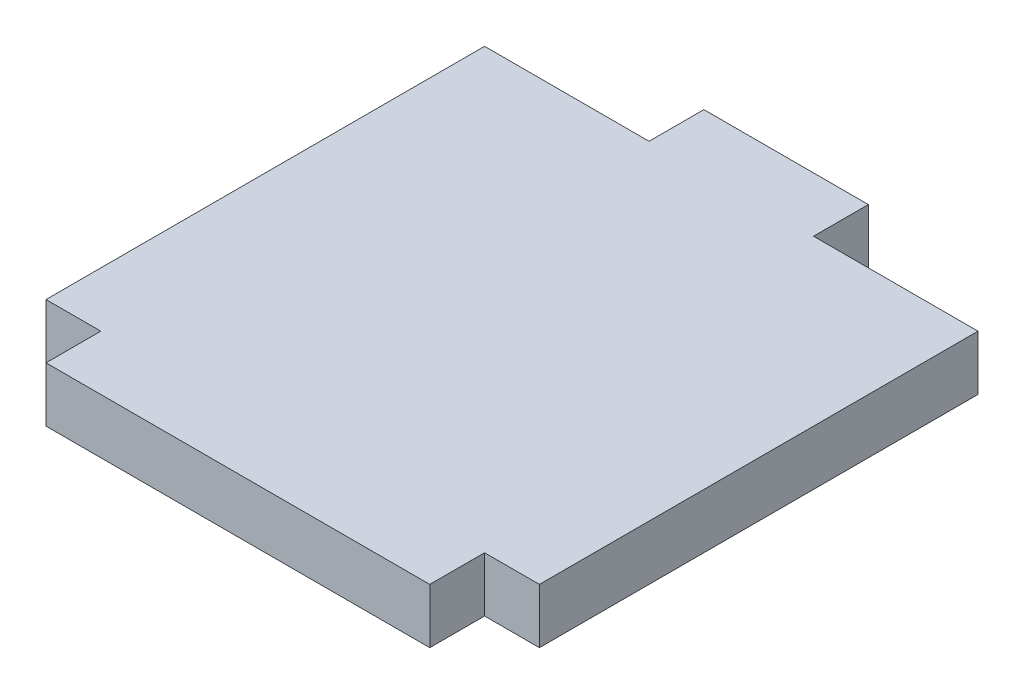
ISO-10303-21;
HEADER;
FILE_DESCRIPTION(('STEP AP214'),'2;1');
FILE_NAME('part.step','',(''),(''),'','','');
FILE_SCHEMA(('AUTOMOTIVE_DESIGN { 1 0 10303 214 1 1 1 1 }'));
ENDSEC;
DATA;
#1=APPLICATION_CONTEXT('core data for automotive mechanical design processes');
#2=APPLICATION_PROTOCOL_DEFINITION('international standard','automotive_design',2000,#1);
#3=PRODUCT_CONTEXT('',#1,'mechanical');
#4=PRODUCT('Part','Part','',(#3));
#5=PRODUCT_RELATED_PRODUCT_CATEGORY('part','',(#4));
#6=PRODUCT_DEFINITION_FORMATION('','',#4);
#7=PRODUCT_DEFINITION_CONTEXT('part definition',#1,'design');
#8=PRODUCT_DEFINITION('design','',#6,#7);
#9=PRODUCT_DEFINITION_SHAPE('','',#8);
#10=(LENGTH_UNIT() NAMED_UNIT(*) SI_UNIT(.MILLI.,.METRE.));
#11=(NAMED_UNIT(*) PLANE_ANGLE_UNIT() SI_UNIT($,.RADIAN.));
#12=(NAMED_UNIT(*) SI_UNIT($,.STERADIAN.) SOLID_ANGLE_UNIT());
#13=UNCERTAINTY_MEASURE_WITH_UNIT(LENGTH_MEASURE(1.E-05),#10,'distance_accuracy_value','');
#14=(GEOMETRIC_REPRESENTATION_CONTEXT(3) GLOBAL_UNCERTAINTY_ASSIGNED_CONTEXT((#13)) GLOBAL_UNIT_ASSIGNED_CONTEXT((#10,
#11,#12)) REPRESENTATION_CONTEXT('',''));
#15=CARTESIAN_POINT('',(0.,0.,0.));
#16=DIRECTION('',(0.,0.,1.));
#17=DIRECTION('',(1.,0.,0.));
#18=AXIS2_PLACEMENT_3D('',#15,#16,#17);
#19=CARTESIAN_POINT('',(0.,5.,-20.));
#20=DIRECTION('',(0.,0.,-1.));
#21=DIRECTION('',(-1.,0.,0.));
#22=AXIS2_PLACEMENT_3D('',#19,#20,#21);
#23=PLANE('',#22);
#24=DIRECTION('',(1.,0.,0.));
#25=VECTOR('',#24,1.);
#26=CARTESIAN_POINT('',(0.,0.,-20.));
#27=LINE('',#26,#25);
#28=CARTESIAN_POINT('',(7.5,0.,-20.));
#29=VERTEX_POINT('',#28);
#30=CARTESIAN_POINT('',(22.5,0.,-20.));
#31=VERTEX_POINT('',#30);
#32=EDGE_CURVE('E175',#29,#31,#27,.T.);
#33=ORIENTED_EDGE('',*,*,#32,.F.);
#34=DIRECTION('',(0.,1.,0.));
#35=VECTOR('',#34,1.);
#36=CARTESIAN_POINT('',(7.5,0.,-20.));
#37=LINE('',#36,#35);
#38=CARTESIAN_POINT('',(7.5,5.,-20.));
#39=VERTEX_POINT('',#38);
#40=EDGE_CURVE('E124',#29,#39,#37,.T.);
#41=ORIENTED_EDGE('',*,*,#40,.T.);
#42=DIRECTION('',(1.,0.,0.));
#43=VECTOR('',#42,1.);
#44=CARTESIAN_POINT('',(0.,5.,-20.));
#45=LINE('',#44,#43);
#46=CARTESIAN_POINT('',(22.5,5.,-20.));
#47=VERTEX_POINT('',#46);
#48=EDGE_CURVE('E118',#39,#47,#45,.T.);
#49=ORIENTED_EDGE('',*,*,#48,.T.);
#50=DIRECTION('',(0.,-1.,0.));
#51=VECTOR('',#50,1.);
#52=CARTESIAN_POINT('',(22.5,5.,-20.));
#53=LINE('',#52,#51);
#54=EDGE_CURVE('E122',#47,#31,#53,.T.);
#55=ORIENTED_EDGE('',*,*,#54,.T.);
#56=EDGE_LOOP('',(#33,#41,#49,#55));
#57=FACE_BOUND('',#56,.T.);
#58=ADVANCED_FACE('F36',(#57),#23,.T.);
#59=CARTESIAN_POINT('',(0.,5.,20.));
#60=DIRECTION('',(0.,0.,-1.));
#61=DIRECTION('',(-1.,0.,0.));
#62=AXIS2_PLACEMENT_3D('',#59,#60,#61);
#63=PLANE('',#62);
#64=DIRECTION('',(1.,0.,0.));
#65=VECTOR('',#64,1.);
#66=CARTESIAN_POINT('',(0.,0.,20.));
#67=LINE('',#66,#65);
#68=CARTESIAN_POINT('',(-22.5,0.,20.));
#69=VERTEX_POINT('',#68);
#70=CARTESIAN_POINT('',(-17.5,0.,20.));
#71=VERTEX_POINT('',#70);
#72=EDGE_CURVE('E170',#69,#71,#67,.T.);
#73=ORIENTED_EDGE('',*,*,#72,.T.);
#74=DIRECTION('',(0.,-1.,0.));
#75=VECTOR('',#74,1.);
#76=CARTESIAN_POINT('',(-17.5,5.,20.));
#77=LINE('',#76,#75);
#78=CARTESIAN_POINT('',(-17.5,5.,20.));
#79=VERTEX_POINT('',#78);
#80=EDGE_CURVE('E11',#79,#71,#77,.T.);
#81=ORIENTED_EDGE('',*,*,#80,.F.);
#82=DIRECTION('',(1.,0.,0.));
#83=VECTOR('',#82,1.);
#84=CARTESIAN_POINT('',(0.,5.,20.));
#85=LINE('',#84,#83);
#86=CARTESIAN_POINT('',(-22.5,5.,20.));
#87=VERTEX_POINT('',#86);
#88=EDGE_CURVE('E181',#87,#79,#85,.T.);
#89=ORIENTED_EDGE('',*,*,#88,.F.);
#90=DIRECTION('',(0.,-1.,0.));
#91=VECTOR('',#90,1.);
#92=CARTESIAN_POINT('',(-22.5,5.,20.));
#93=LINE('',#92,#91);
#94=EDGE_CURVE('E60',#87,#69,#93,.T.);
#95=ORIENTED_EDGE('',*,*,#94,.T.);
#96=EDGE_LOOP('',(#73,#81,#89,#95));
#97=FACE_BOUND('',#96,.T.);
#98=ADVANCED_FACE('F243',(#97),#63,.F.);
#99=CARTESIAN_POINT('',(-17.5,5.,0.));
#100=DIRECTION('',(1.,0.,0.));
#101=DIRECTION('',(0.,0.,-1.));
#102=AXIS2_PLACEMENT_3D('',#99,#100,#101);
#103=PLANE('',#102);
#104=DIRECTION('',(0.,0.,1.));
#105=VECTOR('',#104,1.);
#106=CARTESIAN_POINT('',(-17.5,0.,0.));
#107=LINE('',#106,#105);
#108=CARTESIAN_POINT('',(-17.5,0.,25.));
#109=VERTEX_POINT('',#108);
#110=EDGE_CURVE('E163',#71,#109,#107,.T.);
#111=ORIENTED_EDGE('',*,*,#110,.T.);
#112=DIRECTION('',(0.,-1.,0.));
#113=VECTOR('',#112,1.);
#114=CARTESIAN_POINT('',(-17.5,5.,25.));
#115=LINE('',#114,#113);
#116=CARTESIAN_POINT('',(-17.5,5.,25.));
#117=VERTEX_POINT('',#116);
#118=EDGE_CURVE('E44',#117,#109,#115,.T.);
#119=ORIENTED_EDGE('',*,*,#118,.F.);
#120=DIRECTION('',(0.,0.,1.));
#121=VECTOR('',#120,1.);
#122=CARTESIAN_POINT('',(-17.5,5.,0.));
#123=LINE('',#122,#121);
#124=EDGE_CURVE('E99',#79,#117,#123,.T.);
#125=ORIENTED_EDGE('',*,*,#124,.F.);
#126=ORIENTED_EDGE('',*,*,#80,.T.);
#127=EDGE_LOOP('',(#111,#119,#125,#126));
#128=FACE_BOUND('',#127,.T.);
#129=ADVANCED_FACE('F38',(#128),#103,.F.);
#130=CARTESIAN_POINT('',(0.,5.,25.));
#131=DIRECTION('',(0.,0.,-1.));
#132=DIRECTION('',(-1.,0.,0.));
#133=AXIS2_PLACEMENT_3D('',#130,#131,#132);
#134=PLANE('',#133);
#135=DIRECTION('',(1.,0.,0.));
#136=VECTOR('',#135,1.);
#137=CARTESIAN_POINT('',(0.,0.,25.));
#138=LINE('',#137,#136);
#139=CARTESIAN_POINT('',(17.5,0.,25.));
#140=VERTEX_POINT('',#139);
#141=EDGE_CURVE('E158',#109,#140,#138,.T.);
#142=ORIENTED_EDGE('',*,*,#141,.T.);
#143=DIRECTION('',(0.,-1.,0.));
#144=VECTOR('',#143,1.);
#145=CARTESIAN_POINT('',(17.5,5.,25.));
#146=LINE('',#145,#144);
#147=CARTESIAN_POINT('',(17.5,5.,25.));
#148=VERTEX_POINT('',#147);
#149=EDGE_CURVE('E150',#148,#140,#146,.T.);
#150=ORIENTED_EDGE('',*,*,#149,.F.);
#151=DIRECTION('',(1.,0.,0.));
#152=VECTOR('',#151,1.);
#153=CARTESIAN_POINT('',(0.,5.,25.));
#154=LINE('',#153,#152);
#155=EDGE_CURVE('E160',#117,#148,#154,.T.);
#156=ORIENTED_EDGE('',*,*,#155,.F.);
#157=ORIENTED_EDGE('',*,*,#118,.T.);
#158=EDGE_LOOP('',(#142,#150,#156,#157));
#159=FACE_BOUND('',#158,.T.);
#160=ADVANCED_FACE('F156',(#159),#134,.F.);
#161=CARTESIAN_POINT('',(17.5,5.,0.));
#162=DIRECTION('',(1.,0.,0.));
#163=DIRECTION('',(0.,0.,-1.));
#164=AXIS2_PLACEMENT_3D('',#161,#162,#163);
#165=PLANE('',#164);
#166=DIRECTION('',(0.,0.,1.));
#167=VECTOR('',#166,1.);
#168=CARTESIAN_POINT('',(17.5,0.,0.));
#169=LINE('',#168,#167);
#170=CARTESIAN_POINT('',(17.5,0.,20.));
#171=VERTEX_POINT('',#170);
#172=EDGE_CURVE('E166',#171,#140,#169,.T.);
#173=ORIENTED_EDGE('',*,*,#172,.F.);
#174=DIRECTION('',(0.,-1.,0.));
#175=VECTOR('',#174,1.);
#176=CARTESIAN_POINT('',(17.5,5.,20.));
#177=LINE('',#176,#175);
#178=CARTESIAN_POINT('',(17.5,5.,20.));
#179=VERTEX_POINT('',#178);
#180=EDGE_CURVE('E144',#179,#171,#177,.T.);
#181=ORIENTED_EDGE('',*,*,#180,.F.);
#182=DIRECTION('',(0.,0.,1.));
#183=VECTOR('',#182,1.);
#184=CARTESIAN_POINT('',(17.5,5.,0.));
#185=LINE('',#184,#183);
#186=EDGE_CURVE('E239',#179,#148,#185,.T.);
#187=ORIENTED_EDGE('',*,*,#186,.T.);
#188=ORIENTED_EDGE('',*,*,#149,.T.);
#189=EDGE_LOOP('',(#173,#181,#187,#188));
#190=FACE_BOUND('',#189,.T.);
#191=ADVANCED_FACE('F242',(#190),#165,.T.);
#192=CARTESIAN_POINT('',(22.5,0.,20.));
#193=VERTEX_POINT('',#192);
#194=EDGE_CURVE('E168',#171,#193,#67,.T.);
#195=ORIENTED_EDGE('',*,*,#194,.T.);
#196=DIRECTION('',(0.,-1.,0.));
#197=VECTOR('',#196,1.);
#198=CARTESIAN_POINT('',(22.5,5.,20.));
#199=LINE('',#198,#197);
#200=CARTESIAN_POINT('',(22.5,5.,20.));
#201=VERTEX_POINT('',#200);
#202=EDGE_CURVE('E141',#201,#193,#199,.T.);
#203=ORIENTED_EDGE('',*,*,#202,.F.);
#204=EDGE_CURVE('E133',#179,#201,#85,.T.);
#205=ORIENTED_EDGE('',*,*,#204,.F.);
#206=ORIENTED_EDGE('',*,*,#180,.T.);
#207=EDGE_LOOP('',(#195,#203,#205,#206));
#208=FACE_BOUND('',#207,.T.);
#209=ADVANCED_FACE('F192',(#208),#63,.F.);
#210=CARTESIAN_POINT('',(22.5,5.,0.));
#211=DIRECTION('',(-1.,0.,0.));
#212=DIRECTION('',(0.,0.,1.));
#213=AXIS2_PLACEMENT_3D('',#210,#211,#212);
#214=PLANE('',#213);
#215=DIRECTION('',(0.,0.,-1.));
#216=VECTOR('',#215,1.);
#217=CARTESIAN_POINT('',(22.5,0.,0.));
#218=LINE('',#217,#216);
#219=EDGE_CURVE('E140',#193,#31,#218,.T.);
#220=ORIENTED_EDGE('',*,*,#219,.T.);
#221=ORIENTED_EDGE('',*,*,#54,.F.);
#222=DIRECTION('',(0.,0.,-1.));
#223=VECTOR('',#222,1.);
#224=CARTESIAN_POINT('',(22.5,5.,0.));
#225=LINE('',#224,#223);
#226=EDGE_CURVE('E127',#201,#47,#225,.T.);
#227=ORIENTED_EDGE('',*,*,#226,.F.);
#228=ORIENTED_EDGE('',*,*,#202,.T.);
#229=EDGE_LOOP('',(#220,#221,#227,#228));
#230=FACE_BOUND('',#229,.T.);
#231=ADVANCED_FACE('F138',(#230),#214,.F.);
#232=DIRECTION('',(0.,1.,0.));
#233=VECTOR('',#232,1.);
#234=CARTESIAN_POINT('',(-7.5,0.,-20.));
#235=LINE('',#234,#233);
#236=CARTESIAN_POINT('',(-7.5,0.,-20.));
#237=VERTEX_POINT('',#236);
#238=CARTESIAN_POINT('',(-7.5,5.,-20.));
#239=VERTEX_POINT('',#238);
#240=EDGE_CURVE('E225',#237,#239,#235,.T.);
#241=ORIENTED_EDGE('',*,*,#240,.F.);
#242=CARTESIAN_POINT('',(-22.5,0.,-20.));
#243=VERTEX_POINT('',#242);
#244=EDGE_CURVE('E176',#243,#237,#27,.T.);
#245=ORIENTED_EDGE('',*,*,#244,.F.);
#246=DIRECTION('',(0.,-1.,0.));
#247=VECTOR('',#246,1.);
#248=CARTESIAN_POINT('',(-22.5,5.,-20.));
#249=LINE('',#248,#247);
#250=CARTESIAN_POINT('',(-22.5,5.,-20.));
#251=VERTEX_POINT('',#250);
#252=EDGE_CURVE('E142',#251,#243,#249,.T.);
#253=ORIENTED_EDGE('',*,*,#252,.F.);
#254=EDGE_CURVE('E126',#251,#239,#45,.T.);
#255=ORIENTED_EDGE('',*,*,#254,.T.);
#256=EDGE_LOOP('',(#241,#245,#253,#255));
#257=FACE_BOUND('',#256,.T.);
#258=ADVANCED_FACE('F252',(#257),#23,.T.);
#259=CARTESIAN_POINT('',(-22.5,5.,0.));
#260=DIRECTION('',(-1.,0.,0.));
#261=DIRECTION('',(0.,0.,1.));
#262=AXIS2_PLACEMENT_3D('',#259,#260,#261);
#263=PLANE('',#262);
#264=DIRECTION('',(0.,0.,-1.));
#265=VECTOR('',#264,1.);
#266=CARTESIAN_POINT('',(-22.5,0.,0.));
#267=LINE('',#266,#265);
#268=EDGE_CURVE('E179',#69,#243,#267,.T.);
#269=ORIENTED_EDGE('',*,*,#268,.F.);
#270=ORIENTED_EDGE('',*,*,#94,.F.);
#271=DIRECTION('',(0.,0.,-1.));
#272=VECTOR('',#271,1.);
#273=CARTESIAN_POINT('',(-22.5,5.,0.));
#274=LINE('',#273,#272);
#275=EDGE_CURVE('E182',#87,#251,#274,.T.);
#276=ORIENTED_EDGE('',*,*,#275,.T.);
#277=ORIENTED_EDGE('',*,*,#252,.T.);
#278=EDGE_LOOP('',(#269,#270,#276,#277));
#279=FACE_BOUND('',#278,.T.);
#280=ADVANCED_FACE('F258',(#279),#263,.T.);
#281=CARTESIAN_POINT('',(0.,5.,0.));
#282=DIRECTION('',(0.,1.,0.));
#283=DIRECTION('',(0.,0.,1.));
#284=AXIS2_PLACEMENT_3D('',#281,#282,#283);
#285=PLANE('',#284);
#286=ORIENTED_EDGE('',*,*,#88,.T.);
#287=ORIENTED_EDGE('',*,*,#124,.T.);
#288=ORIENTED_EDGE('',*,*,#155,.T.);
#289=ORIENTED_EDGE('',*,*,#186,.F.);
#290=ORIENTED_EDGE('',*,*,#204,.T.);
#291=ORIENTED_EDGE('',*,*,#226,.T.);
#292=ORIENTED_EDGE('',*,*,#48,.F.);
#293=DIRECTION('',(0.,0.,-1.));
#294=VECTOR('',#293,1.);
#295=CARTESIAN_POINT('',(7.5,5.,-20.));
#296=LINE('',#295,#294);
#297=CARTESIAN_POINT('',(7.5,5.,-25.));
#298=VERTEX_POINT('',#297);
#299=EDGE_CURVE('E51',#39,#298,#296,.T.);
#300=ORIENTED_EDGE('',*,*,#299,.T.);
#301=DIRECTION('',(-1.,0.,0.));
#302=VECTOR('',#301,1.);
#303=CARTESIAN_POINT('',(-7.5,5.,-25.));
#304=LINE('',#303,#302);
#305=CARTESIAN_POINT('',(-7.5,5.,-25.));
#306=VERTEX_POINT('',#305);
#307=EDGE_CURVE('E217',#298,#306,#304,.T.);
#308=ORIENTED_EDGE('',*,*,#307,.T.);
#309=DIRECTION('',(0.,0.,1.));
#310=VECTOR('',#309,1.);
#311=CARTESIAN_POINT('',(-7.5,5.,-20.));
#312=LINE('',#311,#310);
#313=EDGE_CURVE('E222',#306,#239,#312,.T.);
#314=ORIENTED_EDGE('',*,*,#313,.T.);
#315=ORIENTED_EDGE('',*,*,#254,.F.);
#316=ORIENTED_EDGE('',*,*,#275,.F.);
#317=EDGE_LOOP('',(#286,#287,#288,#289,#290,#291,#292,#300,#308,#314,#315,#316));
#318=FACE_BOUND('',#317,.T.);
#319=ADVANCED_FACE('F130',(#318),#285,.T.);
#320=CARTESIAN_POINT('',(0.,0.,0.));
#321=DIRECTION('',(0.,1.,0.));
#322=DIRECTION('',(0.,0.,1.));
#323=AXIS2_PLACEMENT_3D('',#320,#321,#322);
#324=PLANE('',#323);
#325=ORIENTED_EDGE('',*,*,#72,.F.);
#326=ORIENTED_EDGE('',*,*,#268,.T.);
#327=ORIENTED_EDGE('',*,*,#244,.T.);
#328=DIRECTION('',(0.,0.,1.));
#329=VECTOR('',#328,1.);
#330=CARTESIAN_POINT('',(-7.5,0.,-20.));
#331=LINE('',#330,#329);
#332=CARTESIAN_POINT('',(-7.5,0.,-25.));
#333=VERTEX_POINT('',#332);
#334=EDGE_CURVE('E228',#333,#237,#331,.T.);
#335=ORIENTED_EDGE('',*,*,#334,.F.);
#336=DIRECTION('',(-1.,0.,0.));
#337=VECTOR('',#336,1.);
#338=CARTESIAN_POINT('',(-7.5,0.,-25.));
#339=LINE('',#338,#337);
#340=CARTESIAN_POINT('',(7.5,0.,-25.));
#341=VERTEX_POINT('',#340);
#342=EDGE_CURVE('E218',#341,#333,#339,.T.);
#343=ORIENTED_EDGE('',*,*,#342,.F.);
#344=DIRECTION('',(0.,0.,-1.));
#345=VECTOR('',#344,1.);
#346=CARTESIAN_POINT('',(7.5,0.,-20.));
#347=LINE('',#346,#345);
#348=EDGE_CURVE('E197',#29,#341,#347,.T.);
#349=ORIENTED_EDGE('',*,*,#348,.F.);
#350=ORIENTED_EDGE('',*,*,#32,.T.);
#351=ORIENTED_EDGE('',*,*,#219,.F.);
#352=ORIENTED_EDGE('',*,*,#194,.F.);
#353=ORIENTED_EDGE('',*,*,#172,.T.);
#354=ORIENTED_EDGE('',*,*,#141,.F.);
#355=ORIENTED_EDGE('',*,*,#110,.F.);
#356=EDGE_LOOP('',(#325,#326,#327,#335,#343,#349,#350,#351,#352,#353,#354,#355));
#357=FACE_BOUND('',#356,.T.);
#358=ADVANCED_FACE('F162',(#357),#324,.F.);
#359=CARTESIAN_POINT('',(-7.5,0.,-20.));
#360=DIRECTION('',(-1.,0.,0.));
#361=DIRECTION('',(0.,0.,1.));
#362=AXIS2_PLACEMENT_3D('',#359,#360,#361);
#363=PLANE('',#362);
#364=ORIENTED_EDGE('',*,*,#313,.F.);
#365=DIRECTION('',(0.,1.,0.));
#366=VECTOR('',#365,1.);
#367=CARTESIAN_POINT('',(-7.5,0.,-25.));
#368=LINE('',#367,#366);
#369=EDGE_CURVE('E186',#333,#306,#368,.T.);
#370=ORIENTED_EDGE('',*,*,#369,.F.);
#371=ORIENTED_EDGE('',*,*,#334,.T.);
#372=ORIENTED_EDGE('',*,*,#240,.T.);
#373=EDGE_LOOP('',(#364,#370,#371,#372));
#374=FACE_BOUND('',#373,.T.);
#375=ADVANCED_FACE('F223',(#374),#363,.T.);
#376=CARTESIAN_POINT('',(-7.5,0.,-25.));
#377=DIRECTION('',(0.,0.,-1.));
#378=DIRECTION('',(-1.,0.,0.));
#379=AXIS2_PLACEMENT_3D('',#376,#377,#378);
#380=PLANE('',#379);
#381=ORIENTED_EDGE('',*,*,#307,.F.);
#382=DIRECTION('',(0.,1.,0.));
#383=VECTOR('',#382,1.);
#384=CARTESIAN_POINT('',(7.5,0.,-25.));
#385=LINE('',#384,#383);
#386=EDGE_CURVE('E189',#341,#298,#385,.T.);
#387=ORIENTED_EDGE('',*,*,#386,.F.);
#388=ORIENTED_EDGE('',*,*,#342,.T.);
#389=ORIENTED_EDGE('',*,*,#369,.T.);
#390=EDGE_LOOP('',(#381,#387,#388,#389));
#391=FACE_BOUND('',#390,.T.);
#392=ADVANCED_FACE('F215',(#391),#380,.T.);
#393=CARTESIAN_POINT('',(7.5,0.,-20.));
#394=DIRECTION('',(1.,0.,0.));
#395=DIRECTION('',(0.,0.,-1.));
#396=AXIS2_PLACEMENT_3D('',#393,#394,#395);
#397=PLANE('',#396);
#398=ORIENTED_EDGE('',*,*,#299,.F.);
#399=ORIENTED_EDGE('',*,*,#40,.F.);
#400=ORIENTED_EDGE('',*,*,#348,.T.);
#401=ORIENTED_EDGE('',*,*,#386,.T.);
#402=EDGE_LOOP('',(#398,#399,#400,#401));
#403=FACE_BOUND('',#402,.T.);
#404=ADVANCED_FACE('F267',(#403),#397,.T.);
#405=CLOSED_SHELL('',(#58,#98,#129,#160,#191,#209,#231,#258,#280,#319,#358,#375,#392,#404));
#406=MANIFOLD_SOLID_BREP('B2',#405);
#407=ADVANCED_BREP_SHAPE_REPRESENTATION('',(#18,#406),#14);
#408=SHAPE_DEFINITION_REPRESENTATION(#9,#407);
ENDSEC;
END-ISO-10303-21;
